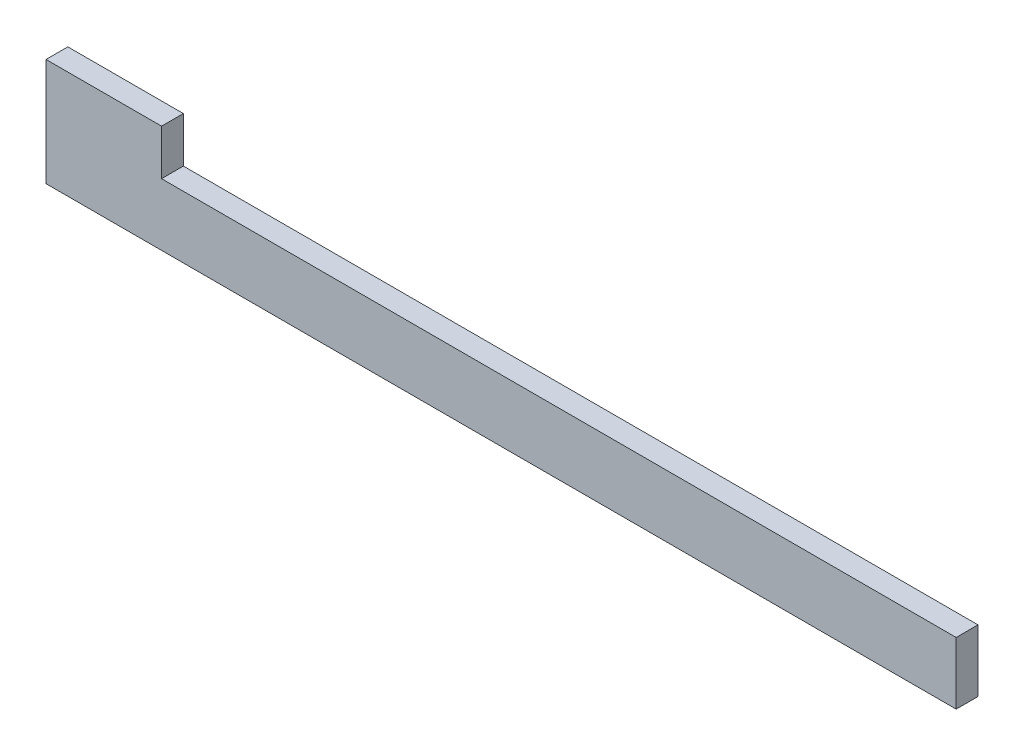
ISO-10303-21;
HEADER;
FILE_DESCRIPTION(('STEP AP214'),'2;1');
FILE_NAME('part.step','',(''),(''),'','','');
FILE_SCHEMA(('AUTOMOTIVE_DESIGN { 1 0 10303 214 1 1 1 1 }'));
ENDSEC;
DATA;
#1=APPLICATION_CONTEXT('core data for automotive mechanical design processes');
#2=APPLICATION_PROTOCOL_DEFINITION('international standard','automotive_design',2000,#1);
#3=PRODUCT_CONTEXT('',#1,'mechanical');
#4=PRODUCT('Part','Part','',(#3));
#5=PRODUCT_RELATED_PRODUCT_CATEGORY('part','',(#4));
#6=PRODUCT_DEFINITION_FORMATION('','',#4);
#7=PRODUCT_DEFINITION_CONTEXT('part definition',#1,'design');
#8=PRODUCT_DEFINITION('design','',#6,#7);
#9=PRODUCT_DEFINITION_SHAPE('','',#8);
#10=(LENGTH_UNIT() NAMED_UNIT(*) SI_UNIT(.MILLI.,.METRE.));
#11=(NAMED_UNIT(*) PLANE_ANGLE_UNIT() SI_UNIT($,.RADIAN.));
#12=(NAMED_UNIT(*) SI_UNIT($,.STERADIAN.) SOLID_ANGLE_UNIT());
#13=UNCERTAINTY_MEASURE_WITH_UNIT(LENGTH_MEASURE(1.E-05),#10,'distance_accuracy_value','');
#14=(GEOMETRIC_REPRESENTATION_CONTEXT(3) GLOBAL_UNCERTAINTY_ASSIGNED_CONTEXT((#13)) GLOBAL_UNIT_ASSIGNED_CONTEXT((#10,
#11,#12)) REPRESENTATION_CONTEXT('',''));
#15=CARTESIAN_POINT('',(0.,0.,0.));
#16=DIRECTION('',(0.,0.,1.));
#17=DIRECTION('',(1.,0.,0.));
#18=AXIS2_PLACEMENT_3D('',#15,#16,#17);
#19=CARTESIAN_POINT('',(334.308144958737,-18.4405046249142,10.));
#20=DIRECTION('',(0.,1.,0.));
#21=DIRECTION('',(-1.,0.,0.));
#22=AXIS2_PLACEMENT_3D('',#19,#20,#21);
#23=PLANE('',#22);
#24=DIRECTION('',(1.,0.,0.));
#25=VECTOR('',#24,1.);
#26=CARTESIAN_POINT('',(334.308144958737,-18.4405046249142,0.));
#27=LINE('',#26,#25);
#28=CARTESIAN_POINT('',(-82.5313264205622,-18.4405046249142,0.));
#29=VERTEX_POINT('',#28);
#30=CARTESIAN_POINT('',(334.308144958737,-18.4405046249142,0.));
#31=VERTEX_POINT('',#30);
#32=EDGE_CURVE('E120',#29,#31,#27,.T.);
#33=ORIENTED_EDGE('',*,*,#32,.T.);
#34=DIRECTION('',(0.,0.,-1.));
#35=VECTOR('',#34,1.);
#36=CARTESIAN_POINT('',(334.308144958737,-18.4405046249142,10.));
#37=LINE('',#36,#35);
#38=CARTESIAN_POINT('',(334.308144958737,-18.4405046249142,10.));
#39=VERTEX_POINT('',#38);
#40=EDGE_CURVE('E11',#39,#31,#37,.T.);
#41=ORIENTED_EDGE('',*,*,#40,.F.);
#42=DIRECTION('',(1.,0.,0.));
#43=VECTOR('',#42,1.);
#44=CARTESIAN_POINT('',(334.308144958737,-18.4405046249142,10.));
#45=LINE('',#44,#43);
#46=CARTESIAN_POINT('',(-82.5313264205622,-18.4405046249142,10.));
#47=VERTEX_POINT('',#46);
#48=EDGE_CURVE('E131',#47,#39,#45,.T.);
#49=ORIENTED_EDGE('',*,*,#48,.F.);
#50=DIRECTION('',(0.,0.,-1.));
#51=VECTOR('',#50,1.);
#52=CARTESIAN_POINT('',(-82.5313264205622,-18.4405046249142,10.));
#53=LINE('',#52,#51);
#54=EDGE_CURVE('E116',#47,#29,#53,.T.);
#55=ORIENTED_EDGE('',*,*,#54,.T.);
#56=EDGE_LOOP('',(#33,#41,#49,#55));
#57=FACE_BOUND('',#56,.T.);
#58=ADVANCED_FACE('F35',(#57),#23,.F.);
#59=CARTESIAN_POINT('',(334.308144958737,10.,10.));
#60=DIRECTION('',(-1.,0.,0.));
#61=DIRECTION('',(0.,0.,1.));
#62=AXIS2_PLACEMENT_3D('',#59,#60,#61);
#63=PLANE('',#62);
#64=DIRECTION('',(0.,1.,0.));
#65=VECTOR('',#64,1.);
#66=CARTESIAN_POINT('',(334.308144958737,10.,0.));
#67=LINE('',#66,#65);
#68=CARTESIAN_POINT('',(334.308144958737,10.,0.));
#69=VERTEX_POINT('',#68);
#70=EDGE_CURVE('E123',#31,#69,#67,.T.);
#71=ORIENTED_EDGE('',*,*,#70,.T.);
#72=DIRECTION('',(0.,0.,-1.));
#73=VECTOR('',#72,1.);
#74=CARTESIAN_POINT('',(334.308144958737,10.,10.));
#75=LINE('',#74,#73);
#76=CARTESIAN_POINT('',(334.308144958737,10.,10.));
#77=VERTEX_POINT('',#76);
#78=EDGE_CURVE('E43',#77,#69,#75,.T.);
#79=ORIENTED_EDGE('',*,*,#78,.F.);
#80=DIRECTION('',(0.,1.,0.));
#81=VECTOR('',#80,1.);
#82=CARTESIAN_POINT('',(334.308144958737,10.,10.));
#83=LINE('',#82,#81);
#84=EDGE_CURVE('E86',#39,#77,#83,.T.);
#85=ORIENTED_EDGE('',*,*,#84,.F.);
#86=ORIENTED_EDGE('',*,*,#40,.T.);
#87=EDGE_LOOP('',(#71,#79,#85,#86));
#88=FACE_BOUND('',#87,.T.);
#89=ADVANCED_FACE('F145',(#88),#63,.F.);
#90=CARTESIAN_POINT('',(-29.6145643705606,10.,10.));
#91=DIRECTION('',(0.,-1.,0.));
#92=DIRECTION('',(1.,0.,0.));
#93=AXIS2_PLACEMENT_3D('',#90,#91,#92);
#94=PLANE('',#93);
#95=DIRECTION('',(-1.,0.,0.));
#96=VECTOR('',#95,1.);
#97=CARTESIAN_POINT('',(-29.6145643705606,10.,0.));
#98=LINE('',#97,#96);
#99=CARTESIAN_POINT('',(-29.6145643705606,10.,0.));
#100=VERTEX_POINT('',#99);
#101=EDGE_CURVE('E125',#69,#100,#98,.T.);
#102=ORIENTED_EDGE('',*,*,#101,.T.);
#103=DIRECTION('',(0.,0.,-1.));
#104=VECTOR('',#103,1.);
#105=CARTESIAN_POINT('',(-29.6145643705606,10.,10.));
#106=LINE('',#105,#104);
#107=CARTESIAN_POINT('',(-29.6145643705606,10.,10.));
#108=VERTEX_POINT('',#107);
#109=EDGE_CURVE('E111',#108,#100,#106,.T.);
#110=ORIENTED_EDGE('',*,*,#109,.F.);
#111=DIRECTION('',(-1.,0.,0.));
#112=VECTOR('',#111,1.);
#113=CARTESIAN_POINT('',(-29.6145643705606,10.,10.));
#114=LINE('',#113,#112);
#115=EDGE_CURVE('E100',#77,#108,#114,.T.);
#116=ORIENTED_EDGE('',*,*,#115,.F.);
#117=ORIENTED_EDGE('',*,*,#78,.T.);
#118=EDGE_LOOP('',(#102,#110,#116,#117));
#119=FACE_BOUND('',#118,.T.);
#120=ADVANCED_FACE('F137',(#119),#94,.F.);
#121=CARTESIAN_POINT('',(-29.6145643705606,30.8351322207664,10.));
#122=DIRECTION('',(-1.,0.,0.));
#123=DIRECTION('',(0.,-1.,0.));
#124=AXIS2_PLACEMENT_3D('',#121,#122,#123);
#125=PLANE('',#124);
#126=DIRECTION('',(0.,1.,0.));
#127=VECTOR('',#126,1.);
#128=CARTESIAN_POINT('',(-29.6145643705606,30.8351322207664,0.));
#129=LINE('',#128,#127);
#130=CARTESIAN_POINT('',(-29.6145643705606,30.8351322207664,0.));
#131=VERTEX_POINT('',#130);
#132=EDGE_CURVE('E109',#100,#131,#129,.T.);
#133=ORIENTED_EDGE('',*,*,#132,.T.);
#134=DIRECTION('',(0.,0.,-1.));
#135=VECTOR('',#134,1.);
#136=CARTESIAN_POINT('',(-29.6145643705606,30.8351322207664,10.));
#137=LINE('',#136,#135);
#138=CARTESIAN_POINT('',(-29.6145643705606,30.8351322207664,10.));
#139=VERTEX_POINT('',#138);
#140=EDGE_CURVE('E106',#139,#131,#137,.T.);
#141=ORIENTED_EDGE('',*,*,#140,.F.);
#142=DIRECTION('',(0.,1.,0.));
#143=VECTOR('',#142,1.);
#144=CARTESIAN_POINT('',(-29.6145643705606,30.8351322207664,10.));
#145=LINE('',#144,#143);
#146=EDGE_CURVE('E93',#108,#139,#145,.T.);
#147=ORIENTED_EDGE('',*,*,#146,.F.);
#148=ORIENTED_EDGE('',*,*,#109,.T.);
#149=EDGE_LOOP('',(#133,#141,#147,#148));
#150=FACE_BOUND('',#149,.T.);
#151=ADVANCED_FACE('F107',(#150),#125,.F.);
#152=CARTESIAN_POINT('',(-82.5313264205622,30.8351322207664,10.));
#153=DIRECTION('',(0.,-1.,0.));
#154=DIRECTION('',(1.,0.,0.));
#155=AXIS2_PLACEMENT_3D('',#152,#153,#154);
#156=PLANE('',#155);
#157=DIRECTION('',(-1.,0.,0.));
#158=VECTOR('',#157,1.);
#159=CARTESIAN_POINT('',(-82.5313264205622,30.8351322207664,0.));
#160=LINE('',#159,#158);
#161=CARTESIAN_POINT('',(-82.5313264205622,30.8351322207664,0.));
#162=VERTEX_POINT('',#161);
#163=EDGE_CURVE('E128',#131,#162,#160,.T.);
#164=ORIENTED_EDGE('',*,*,#163,.T.);
#165=DIRECTION('',(0.,0.,-1.));
#166=VECTOR('',#165,1.);
#167=CARTESIAN_POINT('',(-82.5313264205622,30.8351322207664,10.));
#168=LINE('',#167,#166);
#169=CARTESIAN_POINT('',(-82.5313264205622,30.8351322207664,10.));
#170=VERTEX_POINT('',#169);
#171=EDGE_CURVE('E112',#170,#162,#168,.T.);
#172=ORIENTED_EDGE('',*,*,#171,.F.);
#173=DIRECTION('',(-1.,0.,0.));
#174=VECTOR('',#173,1.);
#175=CARTESIAN_POINT('',(-82.5313264205622,30.8351322207664,10.));
#176=LINE('',#175,#174);
#177=EDGE_CURVE('E97',#139,#170,#176,.T.);
#178=ORIENTED_EDGE('',*,*,#177,.F.);
#179=ORIENTED_EDGE('',*,*,#140,.T.);
#180=EDGE_LOOP('',(#164,#172,#178,#179));
#181=FACE_BOUND('',#180,.T.);
#182=ADVANCED_FACE('F114',(#181),#156,.F.);
#183=CARTESIAN_POINT('',(-82.5313264205622,-18.4405046249142,10.));
#184=DIRECTION('',(1.,0.,0.));
#185=DIRECTION('',(0.,0.,-1.));
#186=AXIS2_PLACEMENT_3D('',#183,#184,#185);
#187=PLANE('',#186);
#188=DIRECTION('',(0.,-1.,0.));
#189=VECTOR('',#188,1.);
#190=CARTESIAN_POINT('',(-82.5313264205622,-18.4405046249142,0.));
#191=LINE('',#190,#189);
#192=EDGE_CURVE('E74',#162,#29,#191,.T.);
#193=ORIENTED_EDGE('',*,*,#192,.T.);
#194=ORIENTED_EDGE('',*,*,#54,.F.);
#195=DIRECTION('',(0.,-1.,0.));
#196=VECTOR('',#195,1.);
#197=CARTESIAN_POINT('',(-82.5313264205622,10.,10.));
#198=LINE('',#197,#196);
#199=EDGE_CURVE('E51',#170,#47,#198,.T.);
#200=ORIENTED_EDGE('',*,*,#199,.F.);
#201=ORIENTED_EDGE('',*,*,#171,.T.);
#202=EDGE_LOOP('',(#193,#194,#200,#201));
#203=FACE_BOUND('',#202,.T.);
#204=ADVANCED_FACE('F139',(#203),#187,.F.);
#205=CARTESIAN_POINT('',(0.,0.,10.));
#206=DIRECTION('',(0.,0.,-1.));
#207=DIRECTION('',(-1.,0.,0.));
#208=AXIS2_PLACEMENT_3D('',#205,#206,#207);
#209=PLANE('',#208);
#210=ORIENTED_EDGE('',*,*,#48,.T.);
#211=ORIENTED_EDGE('',*,*,#84,.T.);
#212=ORIENTED_EDGE('',*,*,#115,.T.);
#213=ORIENTED_EDGE('',*,*,#146,.T.);
#214=ORIENTED_EDGE('',*,*,#177,.T.);
#215=ORIENTED_EDGE('',*,*,#199,.T.);
#216=EDGE_LOOP('',(#210,#211,#212,#213,#214,#215));
#217=FACE_BOUND('',#216,.T.);
#218=ADVANCED_FACE('F95',(#217),#209,.F.);
#219=CARTESIAN_POINT('',(0.,0.,0.));
#220=DIRECTION('',(0.,0.,-1.));
#221=DIRECTION('',(-1.,0.,0.));
#222=AXIS2_PLACEMENT_3D('',#219,#220,#221);
#223=PLANE('',#222);
#224=ORIENTED_EDGE('',*,*,#32,.F.);
#225=ORIENTED_EDGE('',*,*,#192,.F.);
#226=ORIENTED_EDGE('',*,*,#163,.F.);
#227=ORIENTED_EDGE('',*,*,#132,.F.);
#228=ORIENTED_EDGE('',*,*,#101,.F.);
#229=ORIENTED_EDGE('',*,*,#70,.F.);
#230=EDGE_LOOP('',(#224,#225,#226,#227,#228,#229));
#231=FACE_BOUND('',#230,.T.);
#232=ADVANCED_FACE('F138',(#231),#223,.T.);
#233=CLOSED_SHELL('',(#58,#89,#120,#151,#182,#204,#218,#232));
#234=MANIFOLD_SOLID_BREP('B2',#233);
#235=ADVANCED_BREP_SHAPE_REPRESENTATION('',(#18,#234),#14);
#236=SHAPE_DEFINITION_REPRESENTATION(#9,#235);
ENDSEC;
END-ISO-10303-21;
